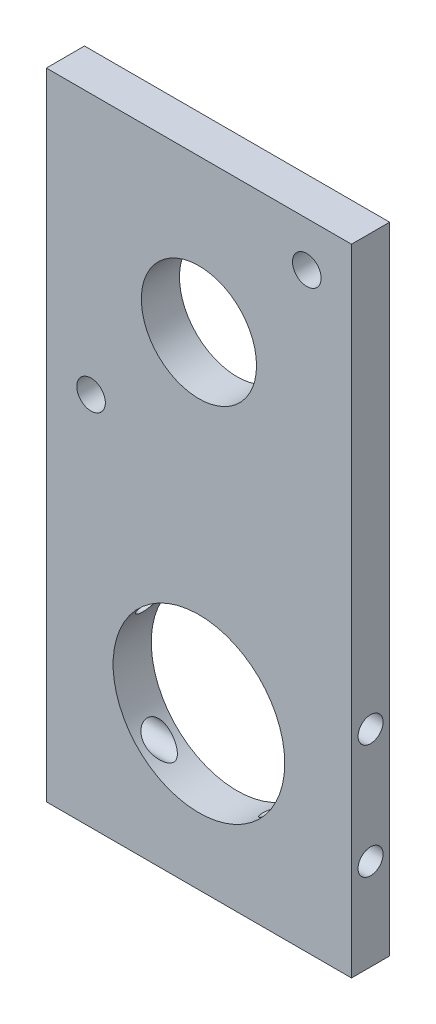
ISO-10303-21;
HEADER;
FILE_DESCRIPTION(('STEP AP214'),'2;1');
FILE_NAME('part.step','',(''),(''),'','','');
FILE_SCHEMA(('AUTOMOTIVE_DESIGN { 1 0 10303 214 1 1 1 1 }'));
ENDSEC;
DATA;
#1=APPLICATION_CONTEXT('core data for automotive mechanical design processes');
#2=APPLICATION_PROTOCOL_DEFINITION('international standard','automotive_design',2000,#1);
#3=PRODUCT_CONTEXT('',#1,'mechanical');
#4=PRODUCT('Part','Part','',(#3));
#5=PRODUCT_RELATED_PRODUCT_CATEGORY('part','',(#4));
#6=PRODUCT_DEFINITION_FORMATION('','',#4);
#7=PRODUCT_DEFINITION_CONTEXT('part definition',#1,'design');
#8=PRODUCT_DEFINITION('design','',#6,#7);
#9=PRODUCT_DEFINITION_SHAPE('','',#8);
#10=(LENGTH_UNIT() NAMED_UNIT(*) SI_UNIT(.MILLI.,.METRE.));
#11=(NAMED_UNIT(*) PLANE_ANGLE_UNIT() SI_UNIT($,.RADIAN.));
#12=(NAMED_UNIT(*) SI_UNIT($,.STERADIAN.) SOLID_ANGLE_UNIT());
#13=UNCERTAINTY_MEASURE_WITH_UNIT(LENGTH_MEASURE(1.E-05),#10,'distance_accuracy_value','');
#14=(GEOMETRIC_REPRESENTATION_CONTEXT(3) GLOBAL_UNCERTAINTY_ASSIGNED_CONTEXT((#13)) GLOBAL_UNIT_ASSIGNED_CONTEXT((#10,
#11,#12)) REPRESENTATION_CONTEXT('',''));
#15=CARTESIAN_POINT('',(0.,0.,0.));
#16=DIRECTION('',(0.,0.,1.));
#17=DIRECTION('',(1.,0.,0.));
#18=AXIS2_PLACEMENT_3D('',#15,#16,#17);
#19=CARTESIAN_POINT('',(0.,0.,6.35));
#20=DIRECTION('',(0.,0.,-1.));
#21=DIRECTION('',(-1.,0.,0.));
#22=AXIS2_PLACEMENT_3D('',#19,#20,#21);
#23=PLANE('',#22);
#24=DIRECTION('',(0.,-1.,0.));
#25=VECTOR('',#24,1.);
#26=CARTESIAN_POINT('',(-25.4,25.4,6.35));
#27=LINE('',#26,#25);
#28=CARTESIAN_POINT('',(-25.4,25.4,6.35));
#29=VERTEX_POINT('',#28);
#30=CARTESIAN_POINT('',(-25.4,-80.399998966,6.35));
#31=VERTEX_POINT('',#30);
#32=EDGE_CURVE('E93',#29,#31,#27,.T.);
#33=ORIENTED_EDGE('',*,*,#32,.T.);
#34=DIRECTION('',(1.,0.,0.));
#35=VECTOR('',#34,1.);
#36=CARTESIAN_POINT('',(25.4,-80.399998966,6.35));
#37=LINE('',#36,#35);
#38=CARTESIAN_POINT('',(25.4,-80.399998966,6.35));
#39=VERTEX_POINT('',#38);
#40=EDGE_CURVE('E88',#31,#39,#37,.T.);
#41=ORIENTED_EDGE('',*,*,#40,.T.);
#42=DIRECTION('',(0.,1.,0.));
#43=VECTOR('',#42,1.);
#44=CARTESIAN_POINT('',(25.4,25.4,6.35));
#45=LINE('',#44,#43);
#46=CARTESIAN_POINT('',(25.4,25.4,6.35));
#47=VERTEX_POINT('',#46);
#48=EDGE_CURVE('E91',#39,#47,#45,.T.);
#49=ORIENTED_EDGE('',*,*,#48,.T.);
#50=DIRECTION('',(-1.,0.,0.));
#51=VECTOR('',#50,1.);
#52=CARTESIAN_POINT('',(25.4,25.4,6.35));
#53=LINE('',#52,#51);
#54=EDGE_CURVE('E58',#47,#29,#53,.T.);
#55=ORIENTED_EDGE('',*,*,#54,.T.);
#56=EDGE_LOOP('',(#33,#41,#49,#55));
#57=FACE_BOUND('',#56,.T.);
#58=CARTESIAN_POINT('',(-17.9605122421383,-17.9605122421383,6.35));
#59=DIRECTION('',(0.,0.,1.));
#60=DIRECTION('',(1.,0.,0.));
#61=AXIS2_PLACEMENT_3D('',#58,#59,#60);
#62=CIRCLE('',#61,2.38125);
#63=CARTESIAN_POINT('',(-15.5792622421383,-17.9605122421383,6.35));
#64=VERTEX_POINT('',#63);
#65=EDGE_CURVE('E109',#64,#64,#62,.T.);
#66=ORIENTED_EDGE('',*,*,#65,.F.);
#67=EDGE_LOOP('',(#66));
#68=FACE_BOUND('',#67,.T.);
#69=CARTESIAN_POINT('',(0.,0.,6.35));
#70=DIRECTION('',(0.,0.,1.));
#71=DIRECTION('',(1.,0.,0.));
#72=AXIS2_PLACEMENT_3D('',#69,#70,#71);
#73=CIRCLE('',#72,9.5885);
#74=CARTESIAN_POINT('',(9.5885,0.,6.35));
#75=VERTEX_POINT('',#74);
#76=EDGE_CURVE('E179',#75,#75,#73,.T.);
#77=ORIENTED_EDGE('',*,*,#76,.F.);
#78=EDGE_LOOP('',(#77));
#79=FACE_BOUND('',#78,.T.);
#80=CARTESIAN_POINT('',(17.9605122421383,17.9605122421383,6.35));
#81=DIRECTION('',(0.,0.,1.));
#82=DIRECTION('',(1.,0.,0.));
#83=AXIS2_PLACEMENT_3D('',#80,#81,#82);
#84=CIRCLE('',#83,2.38125);
#85=CARTESIAN_POINT('',(20.3417622421383,17.9605122421383,6.35));
#86=VERTEX_POINT('',#85);
#87=EDGE_CURVE('E173',#86,#86,#84,.T.);
#88=ORIENTED_EDGE('',*,*,#87,.F.);
#89=EDGE_LOOP('',(#88));
#90=FACE_BOUND('',#89,.T.);
#91=CARTESIAN_POINT('',(0.,-54.999998966,6.35));
#92=DIRECTION('',(0.,0.,1.));
#93=DIRECTION('',(1.,0.,0.));
#94=AXIS2_PLACEMENT_3D('',#91,#92,#93);
#95=CIRCLE('',#94,14.2875);
#96=CARTESIAN_POINT('',(14.2875,-54.999998966,6.35));
#97=VERTEX_POINT('',#96);
#98=EDGE_CURVE('E164',#97,#97,#95,.T.);
#99=ORIENTED_EDGE('',*,*,#98,.F.);
#100=EDGE_LOOP('',(#99));
#101=FACE_BOUND('',#100,.T.);
#102=ADVANCED_FACE('F34',(#57,#68,#79,#90,#101),#23,.F.);
#103=CARTESIAN_POINT('',(0.,0.,0.));
#104=DIRECTION('',(0.,0.,-1.));
#105=DIRECTION('',(-1.,0.,0.));
#106=AXIS2_PLACEMENT_3D('',#103,#104,#105);
#107=PLANE('',#106);
#108=CARTESIAN_POINT('',(17.9605122421383,17.9605122421383,0.));
#109=DIRECTION('',(0.,0.,1.));
#110=DIRECTION('',(1.,0.,0.));
#111=AXIS2_PLACEMENT_3D('',#108,#109,#110);
#112=CIRCLE('',#111,2.38125);
#113=CARTESIAN_POINT('',(20.3417622421383,17.9605122421383,0.));
#114=VERTEX_POINT('',#113);
#115=EDGE_CURVE('E169',#114,#114,#112,.T.);
#116=ORIENTED_EDGE('',*,*,#115,.T.);
#117=EDGE_LOOP('',(#116));
#118=FACE_BOUND('',#117,.T.);
#119=CARTESIAN_POINT('',(-17.9605122421383,-17.9605122421383,0.));
#120=DIRECTION('',(0.,0.,1.));
#121=DIRECTION('',(1.,0.,0.));
#122=AXIS2_PLACEMENT_3D('',#119,#120,#121);
#123=CIRCLE('',#122,2.38125);
#124=CARTESIAN_POINT('',(-15.5792622421383,-17.9605122421383,0.));
#125=VERTEX_POINT('',#124);
#126=EDGE_CURVE('E182',#125,#125,#123,.T.);
#127=ORIENTED_EDGE('',*,*,#126,.T.);
#128=EDGE_LOOP('',(#127));
#129=FACE_BOUND('',#128,.T.);
#130=DIRECTION('',(0.,-1.,0.));
#131=VECTOR('',#130,1.);
#132=CARTESIAN_POINT('',(-25.4,25.4,0.));
#133=LINE('',#132,#131);
#134=CARTESIAN_POINT('',(-25.4,25.4,0.));
#135=VERTEX_POINT('',#134);
#136=CARTESIAN_POINT('',(-25.4,-80.399998966,0.));
#137=VERTEX_POINT('',#136);
#138=EDGE_CURVE('E106',#135,#137,#133,.T.);
#139=ORIENTED_EDGE('',*,*,#138,.F.);
#140=DIRECTION('',(-1.,0.,0.));
#141=VECTOR('',#140,1.);
#142=CARTESIAN_POINT('',(25.4,25.4,0.));
#143=LINE('',#142,#141);
#144=CARTESIAN_POINT('',(25.4,25.4,0.));
#145=VERTEX_POINT('',#144);
#146=EDGE_CURVE('E81',#145,#135,#143,.T.);
#147=ORIENTED_EDGE('',*,*,#146,.F.);
#148=DIRECTION('',(0.,1.,0.));
#149=VECTOR('',#148,1.);
#150=CARTESIAN_POINT('',(25.4,25.4,0.));
#151=LINE('',#150,#149);
#152=CARTESIAN_POINT('',(25.4,-80.399998966,0.));
#153=VERTEX_POINT('',#152);
#154=EDGE_CURVE('E75',#153,#145,#151,.T.);
#155=ORIENTED_EDGE('',*,*,#154,.F.);
#156=DIRECTION('',(1.,0.,0.));
#157=VECTOR('',#156,1.);
#158=CARTESIAN_POINT('',(25.4,-80.399998966,0.));
#159=LINE('',#158,#157);
#160=EDGE_CURVE('E97',#137,#153,#159,.T.);
#161=ORIENTED_EDGE('',*,*,#160,.F.);
#162=EDGE_LOOP('',(#139,#147,#155,#161));
#163=FACE_BOUND('',#162,.T.);
#164=CARTESIAN_POINT('',(0.,0.,0.));
#165=DIRECTION('',(0.,0.,1.));
#166=DIRECTION('',(1.,0.,0.));
#167=AXIS2_PLACEMENT_3D('',#164,#165,#166);
#168=CIRCLE('',#167,9.5885);
#169=CARTESIAN_POINT('',(9.5885,0.,0.));
#170=VERTEX_POINT('',#169);
#171=EDGE_CURVE('E176',#170,#170,#168,.T.);
#172=ORIENTED_EDGE('',*,*,#171,.T.);
#173=EDGE_LOOP('',(#172));
#174=FACE_BOUND('',#173,.T.);
#175=CARTESIAN_POINT('',(0.,-54.999998966,0.));
#176=DIRECTION('',(0.,0.,1.));
#177=DIRECTION('',(1.,0.,0.));
#178=AXIS2_PLACEMENT_3D('',#175,#176,#177);
#179=CIRCLE('',#178,14.2875);
#180=CARTESIAN_POINT('',(14.2875,-54.999998966,0.));
#181=VERTEX_POINT('',#180);
#182=EDGE_CURVE('E149',#181,#181,#179,.T.);
#183=ORIENTED_EDGE('',*,*,#182,.T.);
#184=EDGE_LOOP('',(#183));
#185=FACE_BOUND('',#184,.T.);
#186=ADVANCED_FACE('F190',(#118,#129,#163,#174,#185),#107,.T.);
#187=CARTESIAN_POINT('',(-25.4,25.4,6.35));
#188=DIRECTION('',(1.,0.,0.));
#189=DIRECTION('',(0.,1.,0.));
#190=AXIS2_PLACEMENT_3D('',#187,#188,#189);
#191=PLANE('',#190);
#192=CARTESIAN_POINT('',(-25.4,-65.159998966,3.175));
#193=DIRECTION('',(1.,0.,0.));
#194=DIRECTION('',(0.,1.,0.));
#195=AXIS2_PLACEMENT_3D('',#192,#193,#194);
#196=CIRCLE('',#195,2.0828);
#197=CARTESIAN_POINT('',(-25.4,-63.077198966,3.175));
#198=VERTEX_POINT('',#197);
#199=EDGE_CURVE('E123',#198,#198,#196,.T.);
#200=ORIENTED_EDGE('',*,*,#199,.T.);
#201=EDGE_LOOP('',(#200));
#202=FACE_BOUND('',#201,.T.);
#203=CARTESIAN_POINT('',(-25.4,-46.109998966,3.175));
#204=DIRECTION('',(1.,0.,0.));
#205=DIRECTION('',(0.,1.,0.));
#206=AXIS2_PLACEMENT_3D('',#203,#204,#205);
#207=CIRCLE('',#206,2.0828);
#208=CARTESIAN_POINT('',(-25.4,-44.027198966,3.175));
#209=VERTEX_POINT('',#208);
#210=EDGE_CURVE('E229',#209,#209,#207,.T.);
#211=ORIENTED_EDGE('',*,*,#210,.T.);
#212=EDGE_LOOP('',(#211));
#213=FACE_BOUND('',#212,.T.);
#214=ORIENTED_EDGE('',*,*,#138,.T.);
#215=DIRECTION('',(0.,0.,-1.));
#216=VECTOR('',#215,1.);
#217=CARTESIAN_POINT('',(-25.4,-80.399998966,6.35));
#218=LINE('',#217,#216);
#219=EDGE_CURVE('E11',#31,#137,#218,.T.);
#220=ORIENTED_EDGE('',*,*,#219,.F.);
#221=ORIENTED_EDGE('',*,*,#32,.F.);
#222=DIRECTION('',(0.,0.,-1.));
#223=VECTOR('',#222,1.);
#224=CARTESIAN_POINT('',(-25.4,25.4,6.35));
#225=LINE('',#224,#223);
#226=EDGE_CURVE('E102',#29,#135,#225,.T.);
#227=ORIENTED_EDGE('',*,*,#226,.T.);
#228=EDGE_LOOP('',(#214,#220,#221,#227));
#229=FACE_BOUND('',#228,.T.);
#230=ADVANCED_FACE('F36',(#202,#213,#229),#191,.F.);
#231=CARTESIAN_POINT('',(25.4,-80.399998966,6.35));
#232=DIRECTION('',(0.,1.,0.));
#233=DIRECTION('',(0.,0.,1.));
#234=AXIS2_PLACEMENT_3D('',#231,#232,#233);
#235=PLANE('',#234);
#236=ORIENTED_EDGE('',*,*,#160,.T.);
#237=DIRECTION('',(0.,0.,-1.));
#238=VECTOR('',#237,1.);
#239=CARTESIAN_POINT('',(25.4,-80.399998966,6.35));
#240=LINE('',#239,#238);
#241=EDGE_CURVE('E49',#39,#153,#240,.T.);
#242=ORIENTED_EDGE('',*,*,#241,.F.);
#243=ORIENTED_EDGE('',*,*,#40,.F.);
#244=ORIENTED_EDGE('',*,*,#219,.T.);
#245=EDGE_LOOP('',(#236,#242,#243,#244));
#246=FACE_BOUND('',#245,.T.);
#247=ADVANCED_FACE('F96',(#246),#235,.F.);
#248=CARTESIAN_POINT('',(25.4,25.4,6.35));
#249=DIRECTION('',(-1.,0.,0.));
#250=DIRECTION('',(0.,-1.,0.));
#251=AXIS2_PLACEMENT_3D('',#248,#249,#250);
#252=PLANE('',#251);
#253=CARTESIAN_POINT('',(25.4,-65.159998966,3.175));
#254=DIRECTION('',(1.,0.,0.));
#255=DIRECTION('',(0.,1.,0.));
#256=AXIS2_PLACEMENT_3D('',#253,#254,#255);
#257=CIRCLE('',#256,2.0828);
#258=CARTESIAN_POINT('',(25.4,-63.077198966,3.175));
#259=VERTEX_POINT('',#258);
#260=EDGE_CURVE('E234',#259,#259,#257,.T.);
#261=ORIENTED_EDGE('',*,*,#260,.F.);
#262=EDGE_LOOP('',(#261));
#263=FACE_BOUND('',#262,.T.);
#264=CARTESIAN_POINT('',(25.4,-46.109998966,3.175));
#265=DIRECTION('',(1.,0.,0.));
#266=DIRECTION('',(0.,1.,0.));
#267=AXIS2_PLACEMENT_3D('',#264,#265,#266);
#268=CIRCLE('',#267,2.0828);
#269=CARTESIAN_POINT('',(25.4,-44.027198966,3.175));
#270=VERTEX_POINT('',#269);
#271=EDGE_CURVE('E235',#270,#270,#268,.T.);
#272=ORIENTED_EDGE('',*,*,#271,.F.);
#273=EDGE_LOOP('',(#272));
#274=FACE_BOUND('',#273,.T.);
#275=ORIENTED_EDGE('',*,*,#154,.T.);
#276=DIRECTION('',(0.,0.,-1.));
#277=VECTOR('',#276,1.);
#278=CARTESIAN_POINT('',(25.4,25.4,6.35));
#279=LINE('',#278,#277);
#280=EDGE_CURVE('E98',#47,#145,#279,.T.);
#281=ORIENTED_EDGE('',*,*,#280,.F.);
#282=ORIENTED_EDGE('',*,*,#48,.F.);
#283=ORIENTED_EDGE('',*,*,#241,.T.);
#284=EDGE_LOOP('',(#275,#281,#282,#283));
#285=FACE_BOUND('',#284,.T.);
#286=ADVANCED_FACE('F100',(#263,#274,#285),#252,.F.);
#287=CARTESIAN_POINT('',(25.4,25.4,6.35));
#288=DIRECTION('',(0.,-1.,0.));
#289=DIRECTION('',(1.,0.,0.));
#290=AXIS2_PLACEMENT_3D('',#287,#288,#289);
#291=PLANE('',#290);
#292=ORIENTED_EDGE('',*,*,#146,.T.);
#293=ORIENTED_EDGE('',*,*,#226,.F.);
#294=ORIENTED_EDGE('',*,*,#54,.F.);
#295=ORIENTED_EDGE('',*,*,#280,.T.);
#296=EDGE_LOOP('',(#292,#293,#294,#295));
#297=FACE_BOUND('',#296,.T.);
#298=ADVANCED_FACE('F196',(#297),#291,.F.);
#299=CARTESIAN_POINT('',(-17.9605122421383,-17.9605122421383,6.35));
#300=DIRECTION('',(0.,0.,-1.));
#301=DIRECTION('',(-1.,0.,0.));
#302=AXIS2_PLACEMENT_3D('',#299,#300,#301);
#303=CYLINDRICAL_SURFACE('',#302,2.38125);
#304=ORIENTED_EDGE('',*,*,#65,.T.);
#305=EDGE_LOOP('',(#304));
#306=FACE_BOUND('',#305,.T.);
#307=ORIENTED_EDGE('',*,*,#126,.F.);
#308=EDGE_LOOP('',(#307));
#309=FACE_BOUND('',#308,.T.);
#310=ADVANCED_FACE('F193',(#306,#309),#303,.F.);
#311=CARTESIAN_POINT('',(0.,0.,6.35));
#312=DIRECTION('',(0.,0.,-1.));
#313=DIRECTION('',(-1.,0.,0.));
#314=AXIS2_PLACEMENT_3D('',#311,#312,#313);
#315=CYLINDRICAL_SURFACE('',#314,9.5885);
#316=ORIENTED_EDGE('',*,*,#76,.T.);
#317=EDGE_LOOP('',(#316));
#318=FACE_BOUND('',#317,.T.);
#319=ORIENTED_EDGE('',*,*,#171,.F.);
#320=EDGE_LOOP('',(#319));
#321=FACE_BOUND('',#320,.T.);
#322=ADVANCED_FACE('F195',(#318,#321),#315,.F.);
#323=CARTESIAN_POINT('',(17.9605122421383,17.9605122421383,6.35));
#324=DIRECTION('',(0.,0.,-1.));
#325=DIRECTION('',(-1.,0.,0.));
#326=AXIS2_PLACEMENT_3D('',#323,#324,#325);
#327=CYLINDRICAL_SURFACE('',#326,2.38125);
#328=ORIENTED_EDGE('',*,*,#87,.T.);
#329=EDGE_LOOP('',(#328));
#330=FACE_BOUND('',#329,.T.);
#331=ORIENTED_EDGE('',*,*,#115,.F.);
#332=EDGE_LOOP('',(#331));
#333=FACE_BOUND('',#332,.T.);
#334=ADVANCED_FACE('F157',(#330,#333),#327,.F.);
#335=CARTESIAN_POINT('',(0.,-54.999998966,6.35));
#336=DIRECTION('',(0.,0.,-1.));
#337=DIRECTION('',(-1.,0.,0.));
#338=AXIS2_PLACEMENT_3D('',#335,#336,#337);
#339=CYLINDRICAL_SURFACE('',#338,14.2875);
#340=CARTESIAN_POINT('',(-11.7852236470082,-63.077198966,3.175));
#341=CARTESIAN_POINT('',(-11.7852200210865,-63.0772061202286,3.27602967904974));
#342=CARTESIAN_POINT('',(-11.7801646655475,-63.0845957641341,3.37712905830519));
#343=CARTESIAN_POINT('',(-11.7601115695199,-63.1137360248958,3.5762709852243));
#344=CARTESIAN_POINT('',(-11.7451036211026,-63.1355013861888,3.67431028609033));
#345=CARTESIAN_POINT('',(-11.7057345254466,-63.192044289194,3.86419652589845));
#346=CARTESIAN_POINT('',(-11.6814033944205,-63.2267800632834,3.95606223659754));
#347=CARTESIAN_POINT('',(-11.6241739829658,-63.3074456435918,4.13179622119825));
#348=CARTESIAN_POINT('',(-11.5912758432201,-63.3533752659907,4.21566462639634));
#349=CARTESIAN_POINT('',(-11.5160108307966,-63.4568557224404,4.37794434711993));
#350=CARTESIAN_POINT('',(-11.4732540769725,-63.5148713023968,4.45587606548645));
#351=CARTESIAN_POINT('',(-11.3804677589648,-63.6384943242396,4.60053543709756));
#352=CARTESIAN_POINT('',(-11.3304343067992,-63.7041058208212,4.66725705938827));
#353=CARTESIAN_POINT('',(-11.2021640350764,-63.8689925913797,4.8145466212034));
#354=CARTESIAN_POINT('',(-11.1208244043545,-63.9709624817474,4.88941785188982));
#355=CARTESIAN_POINT('',(-10.9485558745201,-64.1804287715483,5.0171772409277));
#356=CARTESIAN_POINT('',(-10.8576094962387,-64.2879350556812,5.07002443262991));
#357=CARTESIAN_POINT('',(-10.6388035322822,-64.5385553535987,5.16880468225298));
#358=CARTESIAN_POINT('',(-10.5083134419513,-64.6822611015666,5.20736950824455));
#359=CARTESIAN_POINT('',(-10.2389398173102,-64.9667090071064,5.25382802491593));
#360=CARTESIAN_POINT('',(-10.1000449758161,-65.1074468126519,5.26167942043348));
#361=CARTESIAN_POINT('',(-9.86890837289177,-65.3321357745951,5.25250809263101));
#362=CARTESIAN_POINT('',(-9.77814307623636,-65.4180637821556,5.24351862114927));
#363=CARTESIAN_POINT('',(-9.5952471367907,-65.5867520890157,5.2154043217988));
#364=CARTESIAN_POINT('',(-9.503116611017,-65.6695126576492,5.19628035774935));
#365=CARTESIAN_POINT('',(-9.31805164399702,-65.8315143329004,5.14839030979613));
#366=CARTESIAN_POINT('',(-9.22511624710723,-65.9107502760037,5.1196105751978));
#367=CARTESIAN_POINT('',(-9.03929446608979,-66.0651873698356,5.05270377933805));
#368=CARTESIAN_POINT('',(-8.94640807557255,-66.1403896905116,5.01457944653189));
#369=CARTESIAN_POINT('',(-8.77955370053709,-66.2721366413259,4.93733976630736));
#370=CARTESIAN_POINT('',(-8.70543251299981,-66.3294575589607,4.89987089862276));
#371=CARTESIAN_POINT('',(-8.55828919926967,-66.441015503017,4.81871856859571));
#372=CARTESIAN_POINT('',(-8.48526684706638,-66.4952531701625,4.77503640408209));
#373=CARTESIAN_POINT('',(-8.3412027413082,-66.6002106861735,4.68124952742698));
#374=CARTESIAN_POINT('',(-8.27015612521532,-66.6509397339091,4.63116267327067));
#375=CARTESIAN_POINT('',(-8.13084652329286,-66.7485824912177,4.52396718047853));
#376=CARTESIAN_POINT('',(-8.06258157281335,-66.7954989177213,4.46686361626136));
#377=CARTESIAN_POINT('',(-7.92993354812479,-66.8850835756816,4.34457801539588));
#378=CARTESIAN_POINT('',(-7.86556732368505,-66.9277338235784,4.279364183057));
#379=CARTESIAN_POINT('',(-7.74324201273184,-67.0075037383609,4.13999943724699));
#380=CARTESIAN_POINT('',(-7.68528005065753,-67.0446258900277,4.065852566295));
#381=CARTESIAN_POINT('',(-7.5894107931374,-67.105208081159,3.92269788923124));
#382=CARTESIAN_POINT('',(-7.54978582872229,-67.1299237461775,3.85539374954056));
#383=CARTESIAN_POINT('',(-7.47991064988281,-67.173136724309,3.71421122336098));
#384=CARTESIAN_POINT('',(-7.44964144692973,-67.1916466392207,3.64034654994439));
#385=CARTESIAN_POINT('',(-7.40721237153338,-67.217459335049,3.50446897874408));
#386=CARTESIAN_POINT('',(-7.39250267409782,-67.2263515347495,3.44356570637848));
#387=CARTESIAN_POINT('',(-7.37205515378218,-67.2386920161568,3.3197382978064));
#388=CARTESIAN_POINT('',(-7.36630835190735,-67.2421457461354,3.25681624859801));
#389=CARTESIAN_POINT('',(-7.36441686622699,-67.2432837636755,3.13064229763926));
#390=CARTESIAN_POINT('',(-7.36829168163857,-67.2409563351094,3.06738998571347));
#391=CARTESIAN_POINT('',(-7.38523515588227,-67.2307409830152,2.94258709463044));
#392=CARTESIAN_POINT('',(-7.39831184174228,-67.2228482046773,2.88103805003315));
#393=CARTESIAN_POINT('',(-7.43679505486892,-67.1994807132282,2.74553078489217));
#394=CARTESIAN_POINT('',(-7.46451785584845,-67.1825717080963,2.67248750628224));
#395=CARTESIAN_POINT('',(-7.52938973402054,-67.1425852201885,2.53255621306915));
#396=CARTESIAN_POINT('',(-7.56655869051616,-67.1194947230092,2.46568158993725));
#397=CARTESIAN_POINT('',(-7.67102844457892,-67.0537794274481,2.30125751931205));
#398=CARTESIAN_POINT('',(-7.74331922360056,-67.0075828043981,2.20835122917415));
#399=CARTESIAN_POINT('',(-7.89752421549739,-66.9067338905831,2.03615687839956));
#400=CARTESIAN_POINT('',(-7.97946434959119,-66.8520586930051,1.95690697581905));
#401=CARTESIAN_POINT('',(-8.13635536938147,-66.7447866023788,1.82118781158849));
#402=CARTESIAN_POINT('',(-8.2105308782351,-66.6930919462581,1.76308354888739));
#403=CARTESIAN_POINT('',(-8.36155582012108,-66.5855779297464,1.65459932946993));
#404=CARTESIAN_POINT('',(-8.43840700130724,-66.5297558448834,1.6042245435843));
#405=CARTESIAN_POINT('',(-8.59378977860668,-66.4144112344979,1.51066191223894));
#406=CARTESIAN_POINT('',(-8.67232272797948,-66.3548856494383,1.46748012031238));
#407=CARTESIAN_POINT('',(-8.83028597245094,-66.2324829503101,1.38805946113392));
#408=CARTESIAN_POINT('',(-8.90971638412695,-66.1696053967943,1.35182150710297));
#409=CARTESIAN_POINT('',(-9.07314859531222,-66.037310843421,1.28445026217104));
#410=CARTESIAN_POINT('',(-9.15716827358786,-65.9677239245076,1.25369228116207));
#411=CARTESIAN_POINT('',(-9.32498636729341,-65.8254056053217,1.19988542963599));
#412=CARTESIAN_POINT('',(-9.40878475357643,-65.7526738108024,1.17683752885015));
#413=CARTESIAN_POINT('',(-9.6589420398794,-65.5302887687969,1.11967324176175));
#414=CARTESIAN_POINT('',(-9.82435279881833,-65.3762123900095,1.09741679328825));
#415=CARTESIAN_POINT('',(-10.1236984343917,-65.0836728702183,1.08926434215749));
#416=CARTESIAN_POINT('',(-10.2586232990871,-64.9463507077387,1.09839933669844));
#417=CARTESIAN_POINT('',(-10.520428161798,-64.6689893296188,1.14603362234142));
#418=CARTESIAN_POINT('',(-10.647317589607,-64.5289535604482,1.1844977763711));
#419=CARTESIAN_POINT('',(-10.8607714176662,-64.2841920197262,1.28183845452184));
#420=CARTESIAN_POINT('',(-10.9498126123361,-64.1788894142101,1.33380963256619));
#421=CARTESIAN_POINT('',(-11.1186837516055,-63.973576490209,1.45894025131486));
#422=CARTESIAN_POINT('',(-11.1985261805432,-63.8735591010517,1.53207049032041));
#423=CARTESIAN_POINT('',(-11.3325992889651,-63.701406414198,1.68462768407744));
#424=CARTESIAN_POINT('',(-11.388829853455,-63.6275490471228,1.7603398372177));
#425=CARTESIAN_POINT('',(-11.4919060499564,-63.4897661258315,1.92600731284728));
#426=CARTESIAN_POINT('',(-11.5387517569073,-63.42584049231,2.01596252159348));
#427=CARTESIAN_POINT('',(-11.6217499327717,-63.3109966698791,2.20961230442198));
#428=CARTESIAN_POINT('',(-11.6578132380186,-63.2601873915382,2.31341170194376));
#429=CARTESIAN_POINT('',(-11.7022834978821,-63.1969420960733,2.47651376763692));
#430=CARTESIAN_POINT('',(-11.7155003154065,-63.1780254452704,2.53209742731726));
#431=CARTESIAN_POINT('',(-11.7386078560327,-63.14482257132,2.64529184422147));
#432=CARTESIAN_POINT('',(-11.7485001218647,-63.1305342005699,2.70290164748254));
#433=CARTESIAN_POINT('',(-11.7661316384559,-63.1050026758823,2.82887490706305));
#434=CARTESIAN_POINT('',(-11.7732806544066,-63.094601812151,2.89749486766826));
#435=CARTESIAN_POINT('',(-11.782827659066,-63.080697853337,3.03573224682427));
#436=CARTESIAN_POINT('',(-11.7852261467393,-63.0771940338338,3.10534955984593));
#437=CARTESIAN_POINT('',(-11.7852236470082,-63.077198966,3.175));
#438=B_SPLINE_CURVE_WITH_KNOTS('',3,(#340,#341,#342,#343,#344,#345,#346,#347,#348,#349,#350,
#351,#352,#353,#354,#355,#356,#357,#358,#359,#360,#361,#362,#363,#364,#365,#366,#367,#368,#369,
#370,#371,#372,#373,#374,#375,#376,#377,#378,#379,#380,#381,#382,#383,#384,#385,#386,#387,#388,
#389,#390,#391,#392,#393,#394,#395,#396,#397,#398,#399,#400,#401,#402,#403,#404,#405,#406,#407,
#408,#409,#410,#411,#412,#413,#414,#415,#416,#417,#418,#419,#420,#421,#422,#423,#424,#425,#426,
#427,#428,#429,#430,#431,#432,#433,#434,#435,#436,#437),.UNSPECIFIED.,.T.,.F.,(4,2,2,2,2,2,2,2,
2,2,2,2,2,2,2,2,2,2,2,2,2,2,2,2,2,2,2,2,2,2,2,2,2,2,2,2,2,2,2,2,2,2,2,2,2,2,2,2,4),(0.,
0.302822882057644,0.605956837345417,0.908122935991352,1.21028407294396,1.52748926998896,
1.84486457853834,2.29358161927353,2.74312962748938,3.33368623936297,3.92505581522874,
4.30056929783118,4.6760507784735,5.0520653427947,5.42797024811205,5.73048950159227,
6.0329456576186,6.33457615958716,6.63598979506337,6.93862473036334,7.24112322336332,
7.48610255252898,7.73058135427422,7.91963337805558,8.10849588830665,8.29774146051276,
8.48715232146738,8.7256220256251,8.96459780290731,9.34186266822415,9.72016515400229,
10.0421522194956,10.3643537560449,10.6868250981572,11.0093388211229,11.3490527130979,
11.6888093163577,12.3671610074305,12.9434008756169,13.5189514764676,13.9594832002253,
14.3994098211073,14.7573316742172,15.1152506691558,15.4760523934211,15.6563466946597,
15.8365572159564,16.0453469786543,16.2541148102699),.UNSPECIFIED.);
#439=CARTESIAN_POINT('',(-11.7852236470082,-63.077198966,3.175));
#440=VERTEX_POINT('',#439);
#441=EDGE_CURVE('E38',#440,#440,#438,.T.);
#442=ORIENTED_EDGE('',*,*,#441,.F.);
#443=EDGE_LOOP('',(#442));
#444=FACE_BOUND('',#443,.T.);
#445=CARTESIAN_POINT('',(11.7852236470081,-63.077198966,3.175));
#446=CARTESIAN_POINT('',(11.7852200210865,-63.0772061202286,3.07397032095025));
#447=CARTESIAN_POINT('',(11.7801646655474,-63.0845957641341,2.97287094169481));
#448=CARTESIAN_POINT('',(11.7601115695198,-63.1137360248958,2.77372901477569));
#449=CARTESIAN_POINT('',(11.7451036211026,-63.1355013861888,2.67568971390967));
#450=CARTESIAN_POINT('',(11.7057345254466,-63.192044289194,2.48580347410154));
#451=CARTESIAN_POINT('',(11.6814033944204,-63.2267800632834,2.39393776340246));
#452=CARTESIAN_POINT('',(11.6241739829658,-63.3074456435918,2.21820377880175));
#453=CARTESIAN_POINT('',(11.59127584322,-63.3533752659907,2.13433537360365));
#454=CARTESIAN_POINT('',(11.5160108307966,-63.4568557224404,1.97205565288006));
#455=CARTESIAN_POINT('',(11.4732540769725,-63.5148713023968,1.89412393451354));
#456=CARTESIAN_POINT('',(11.3804677589648,-63.6384943242396,1.74946456290244));
#457=CARTESIAN_POINT('',(11.3304343067992,-63.7041058208212,1.68274294061172));
#458=CARTESIAN_POINT('',(11.2021640350763,-63.8689925913797,1.5354533787966));
#459=CARTESIAN_POINT('',(11.1208244043545,-63.9709624817474,1.46058214811018));
#460=CARTESIAN_POINT('',(10.9485558745201,-64.1804287715483,1.3328227590723));
#461=CARTESIAN_POINT('',(10.8576094962387,-64.2879350556812,1.27997556737009));
#462=CARTESIAN_POINT('',(10.6388035322822,-64.5385553535987,1.18119531774702));
#463=CARTESIAN_POINT('',(10.5083134419512,-64.6822611015666,1.14263049175545));
#464=CARTESIAN_POINT('',(10.2389398173101,-64.9667090071064,1.09617197508407));
#465=CARTESIAN_POINT('',(10.1000449758161,-65.1074468126519,1.08832057956652));
#466=CARTESIAN_POINT('',(9.86890837289173,-65.3321357745951,1.09749190736899));
#467=CARTESIAN_POINT('',(9.77814307623633,-65.4180637821556,1.10648137885073));
#468=CARTESIAN_POINT('',(9.59524713679067,-65.5867520890157,1.13459567820121));
#469=CARTESIAN_POINT('',(9.50311661101697,-65.6695126576492,1.15371964225065));
#470=CARTESIAN_POINT('',(9.31805164399699,-65.8315143329004,1.20160969020387));
#471=CARTESIAN_POINT('',(9.2251162471072,-65.9107502760037,1.2303894248022));
#472=CARTESIAN_POINT('',(9.03929446608976,-66.0651873698356,1.29729622066195));
#473=CARTESIAN_POINT('',(8.94640807557252,-66.1403896905116,1.33542055346812));
#474=CARTESIAN_POINT('',(8.77955370053706,-66.2721366413259,1.41266023369264));
#475=CARTESIAN_POINT('',(8.70543251299978,-66.3294575589607,1.45012910137724));
#476=CARTESIAN_POINT('',(8.55828919926964,-66.441015503017,1.53128143140429));
#477=CARTESIAN_POINT('',(8.48526684706634,-66.4952531701625,1.57496359591792));
#478=CARTESIAN_POINT('',(8.34120274130816,-66.6002106861735,1.66875047257303));
#479=CARTESIAN_POINT('',(8.27015612521529,-66.6509397339091,1.71883732672933));
#480=CARTESIAN_POINT('',(8.13084652329283,-66.7485824912177,1.82603281952147));
#481=CARTESIAN_POINT('',(8.06258157281332,-66.7954989177213,1.88313638373864));
#482=CARTESIAN_POINT('',(7.92993354812476,-66.8850835756816,2.00542198460412));
#483=CARTESIAN_POINT('',(7.86556732368502,-66.9277338235784,2.070635816943));
#484=CARTESIAN_POINT('',(7.74324201273181,-67.0075037383609,2.21000056275301));
#485=CARTESIAN_POINT('',(7.6852800506575,-67.0446258900277,2.28414743370501));
#486=CARTESIAN_POINT('',(7.58941079313737,-67.105208081159,2.42730211076876));
#487=CARTESIAN_POINT('',(7.54978582872226,-67.1299237461775,2.49460625045944));
#488=CARTESIAN_POINT('',(7.47991064988278,-67.173136724309,2.63578877663902));
#489=CARTESIAN_POINT('',(7.4496414469297,-67.1916466392207,2.70965345005562));
#490=CARTESIAN_POINT('',(7.40721237153335,-67.217459335049,2.84553102125593));
#491=CARTESIAN_POINT('',(7.39250267409779,-67.2263515347495,2.90643429362153));
#492=CARTESIAN_POINT('',(7.37205515378215,-67.2386920161568,3.03026170219361));
#493=CARTESIAN_POINT('',(7.36630835190732,-67.2421457461354,3.093183751402));
#494=CARTESIAN_POINT('',(7.36441686622697,-67.2432837636755,3.21935770236075));
#495=CARTESIAN_POINT('',(7.36829168163855,-67.2409563351094,3.28261001428653));
#496=CARTESIAN_POINT('',(7.38523515588225,-67.2307409830152,3.40741290536957));
#497=CARTESIAN_POINT('',(7.39831184174226,-67.2228482046773,3.46896194996686));
#498=CARTESIAN_POINT('',(7.4367950548689,-67.1994807132282,3.60446921510784));
#499=CARTESIAN_POINT('',(7.46451785584843,-67.1825717080963,3.67751249371777));
#500=CARTESIAN_POINT('',(7.52938973402052,-67.1425852201885,3.81744378693086));
#501=CARTESIAN_POINT('',(7.56655869051614,-67.1194947230092,3.88431841006275));
#502=CARTESIAN_POINT('',(7.6710284445789,-67.0537794274481,4.04874248068796));
#503=CARTESIAN_POINT('',(7.74331922360054,-67.007582804398,4.14164877082586));
#504=CARTESIAN_POINT('',(7.89752421549738,-66.9067338905831,4.31384312160045));
#505=CARTESIAN_POINT('',(7.97946434959118,-66.8520586930051,4.39309302418096));
#506=CARTESIAN_POINT('',(8.13635536938146,-66.7447866023788,4.52881218841152));
#507=CARTESIAN_POINT('',(8.21053087823508,-66.6930919462581,4.58691645111262));
#508=CARTESIAN_POINT('',(8.36155582012107,-66.5855779297464,4.69540067053008));
#509=CARTESIAN_POINT('',(8.43840700130723,-66.5297558448834,4.74577545641571));
#510=CARTESIAN_POINT('',(8.59378977860667,-66.4144112344979,4.83933808776108));
#511=CARTESIAN_POINT('',(8.67232272797947,-66.3548856494383,4.88251987968763));
#512=CARTESIAN_POINT('',(8.83028597245093,-66.23248295031,4.9619405388661));
#513=CARTESIAN_POINT('',(8.90971638412695,-66.1696053967943,4.99817849289704));
#514=CARTESIAN_POINT('',(9.07314859531222,-66.037310843421,5.06554973782897));
#515=CARTESIAN_POINT('',(9.15716827358786,-65.9677239245075,5.09630771883794));
#516=CARTESIAN_POINT('',(9.32498636729341,-65.8254056053217,5.15011457036402));
#517=CARTESIAN_POINT('',(9.40878475357643,-65.7526738108024,5.17316247114986));
#518=CARTESIAN_POINT('',(9.65894203987941,-65.5302887687969,5.23032675823826));
#519=CARTESIAN_POINT('',(9.82435279881834,-65.3762123900095,5.25258320671175));
#520=CARTESIAN_POINT('',(10.1236984343917,-65.0836728702183,5.2607356578425));
#521=CARTESIAN_POINT('',(10.2586232990871,-64.9463507077386,5.25160066330156));
#522=CARTESIAN_POINT('',(10.520428161798,-64.6689893296187,5.20396637765858));
#523=CARTESIAN_POINT('',(10.647317589607,-64.5289535604481,5.16550222362889));
#524=CARTESIAN_POINT('',(10.8607714176662,-64.2841920197262,5.06816154547816));
#525=CARTESIAN_POINT('',(10.9498126123361,-64.17888941421,5.0161903674338));
#526=CARTESIAN_POINT('',(11.1186837516055,-63.9735764902089,4.89105974868513));
#527=CARTESIAN_POINT('',(11.1985261805432,-63.8735591010516,4.81792950967958));
#528=CARTESIAN_POINT('',(11.332599288965,-63.7014064141979,4.66537231592255));
#529=CARTESIAN_POINT('',(11.3888298534549,-63.6275490471228,4.58966016278229));
#530=CARTESIAN_POINT('',(11.4919060499563,-63.4897661258315,4.42399268715271));
#531=CARTESIAN_POINT('',(11.5387517569073,-63.42584049231,4.33403747840651));
#532=CARTESIAN_POINT('',(11.6217499327717,-63.3109966698791,4.14038769557801));
#533=CARTESIAN_POINT('',(11.6578132380185,-63.2601873915382,4.03658829805622));
#534=CARTESIAN_POINT('',(11.702283497882,-63.1969420960733,3.87348623236306));
#535=CARTESIAN_POINT('',(11.7155003154064,-63.1780254452704,3.81790257268273));
#536=CARTESIAN_POINT('',(11.7386078560327,-63.14482257132,3.70470815577852));
#537=CARTESIAN_POINT('',(11.7485001218646,-63.1305342005699,3.64709835251744));
#538=CARTESIAN_POINT('',(11.7661316384559,-63.1050026758823,3.52112509293694));
#539=CARTESIAN_POINT('',(11.7732806544066,-63.094601812151,3.45250513233173));
#540=CARTESIAN_POINT('',(11.782827659066,-63.080697853337,3.31426775317572));
#541=CARTESIAN_POINT('',(11.7852261467393,-63.0771940338338,3.24465044015407));
#542=CARTESIAN_POINT('',(11.7852236470081,-63.077198966,3.175));
#543=B_SPLINE_CURVE_WITH_KNOTS('',3,(#445,#446,#447,#448,#449,#450,#451,#452,#453,#454,#455,
#456,#457,#458,#459,#460,#461,#462,#463,#464,#465,#466,#467,#468,#469,#470,#471,#472,#473,#474,
#475,#476,#477,#478,#479,#480,#481,#482,#483,#484,#485,#486,#487,#488,#489,#490,#491,#492,#493,
#494,#495,#496,#497,#498,#499,#500,#501,#502,#503,#504,#505,#506,#507,#508,#509,#510,#511,#512,
#513,#514,#515,#516,#517,#518,#519,#520,#521,#522,#523,#524,#525,#526,#527,#528,#529,#530,#531,
#532,#533,#534,#535,#536,#537,#538,#539,#540,#541,#542),.UNSPECIFIED.,.T.,.F.,(4,2,2,2,2,2,2,2,
2,2,2,2,2,2,2,2,2,2,2,2,2,2,2,2,2,2,2,2,2,2,2,2,2,2,2,2,2,2,2,2,2,2,2,2,2,2,2,2,4),(0.,
0.302822882057645,0.605956837345421,0.908122935991359,1.21028407294397,1.52748926998897,
1.84486457853835,2.29358161927354,2.74312962748938,3.33368623936298,3.92505581522875,
4.30056929783118,4.67605077847351,5.05206534279471,5.42797024811205,5.73048950159229,
6.03294565761861,6.33457615958716,6.63598979506337,6.93862473036334,7.24112322336333,
7.48610255252898,7.73058135427422,7.91963337805558,8.10849588830665,8.29774146051277,
8.48715232146739,8.72562202562511,8.96459780290731,9.34186266822416,9.72016515400231,
10.0421522194956,10.3643537560449,10.6868250981572,11.0093388211229,11.3490527130979,
11.6888093163577,12.3671610074305,12.943400875617,13.5189514764676,13.9594832002253,
14.3994098211073,14.7573316742172,15.1152506691558,15.4760523934211,15.6563466946597,
15.8365572159564,16.0453469786543,16.2541148102699),.UNSPECIFIED.);
#544=CARTESIAN_POINT('',(11.7852236470081,-63.077198966,3.175));
#545=VERTEX_POINT('',#544);
#546=EDGE_CURVE('E142',#545,#545,#543,.T.);
#547=ORIENTED_EDGE('',*,*,#546,.F.);
#548=EDGE_LOOP('',(#547));
#549=FACE_BOUND('',#548,.T.);
#550=CARTESIAN_POINT('',(-9.15042711626077,-44.027198966,3.175));
#551=CARTESIAN_POINT('',(-9.15043989269989,-44.0272081901678,3.26454890008489));
#552=CARTESIAN_POINT('',(-9.15745124702471,-44.0330448509167,3.35424979131611));
#553=CARTESIAN_POINT('',(-9.18461930286792,-44.0557898806743,3.53027266863463));
#554=CARTESIAN_POINT('',(-9.20481297815591,-44.0727293914967,3.61658442483242));
#555=CARTESIAN_POINT('',(-9.25582104119894,-44.1159041378814,3.78237938513075));
#556=CARTESIAN_POINT('',(-9.28652083306931,-44.1420391561943,3.86192515954951));
#557=CARTESIAN_POINT('',(-9.35612647122974,-44.2019589936266,4.01413154413941));
#558=CARTESIAN_POINT('',(-9.39503406139305,-44.235745438522,4.08679068637723));
#559=CARTESIAN_POINT('',(-9.50214858669181,-44.3299803177561,4.26331141002632));
#560=CARTESIAN_POINT('',(-9.57465639179471,-44.3948380007538,4.36219603748722));
#561=CARTESIAN_POINT('',(-9.72859437954164,-44.5358662802053,4.54373252998836));
#562=CARTESIAN_POINT('',(-9.81004853740148,-44.6120674799977,4.62633903266863));
#563=CARTESIAN_POINT('',(-9.95179425490305,-44.7481268322216,4.75267772733697));
#564=CARTESIAN_POINT('',(-10.0107505294306,-44.8056568797475,4.80049363260949));
#565=CARTESIAN_POINT('',(-10.1302652549465,-44.9244099180688,4.88903721909895));
#566=CARTESIAN_POINT('',(-10.1908242656099,-44.9856342087053,4.92976238558257));
#567=CARTESIAN_POINT('',(-10.3738759184891,-45.1742209108612,5.04147877037248));
#568=CARTESIAN_POINT('',(-10.4977890625935,-45.3065408035246,5.10205056017366));
#569=CARTESIAN_POINT('',(-10.7466375876662,-45.5831203951263,5.1954083071399));
#570=CARTESIAN_POINT('',(-10.8715637954867,-45.7275185552292,5.22780321739683));
#571=CARTESIAN_POINT('',(-11.1171266289937,-46.0234213532495,5.26130393859568));
#572=CARTESIAN_POINT('',(-11.2377677855258,-46.1749180668479,5.26244384434584));
#573=CARTESIAN_POINT('',(-11.4492033172386,-46.4517317785038,5.23335956806839));
#574=CARTESIAN_POINT('',(-11.5413516940729,-46.5766294687726,5.20897804458177));
#575=CARTESIAN_POINT('',(-11.7182224659092,-46.8244879243104,5.13566590599119));
#576=CARTESIAN_POINT('',(-11.8029536624519,-46.9474508392748,5.08676486365671));
#577=CARTESIAN_POINT('',(-11.9493878488227,-47.1667849583596,4.97329992613966));
#578=CARTESIAN_POINT('',(-12.0125812593317,-47.2641892775325,4.91266725682844));
#579=CARTESIAN_POINT('',(-12.1306740227791,-47.4507228061496,4.77314250179381));
#580=CARTESIAN_POINT('',(-12.1855751924996,-47.5398538265715,4.69425442534342));
#581=CARTESIAN_POINT('',(-12.2859217666944,-47.70628148007,4.51838710804168));
#582=CARTESIAN_POINT('',(-12.3312994189953,-47.7834923485105,4.42128697124824));
#583=CARTESIAN_POINT('',(-12.4106789061678,-47.9208722116568,4.21156488800134));
#584=CARTESIAN_POINT('',(-12.4446887947846,-47.9810532668563,4.09895401068987));
#585=CARTESIAN_POINT('',(-12.4967198501813,-48.0741676251823,3.87694392773889));
#586=CARTESIAN_POINT('',(-12.5162148490674,-48.1095773980814,3.76892513059467));
#587=CARTESIAN_POINT('',(-12.5451582732518,-48.1624125840402,3.54729627981186));
#588=CARTESIAN_POINT('',(-12.5546126996327,-48.179848739448,3.43368960848855));
#589=CARTESIAN_POINT('',(-12.5628712083591,-48.1950756297197,3.21447240902914));
#590=CARTESIAN_POINT('',(-12.5625067088148,-48.1944000059873,3.10899611497117));
#591=CARTESIAN_POINT('',(-12.5531714604925,-48.1771961437421,2.89974796721376));
#592=CARTESIAN_POINT('',(-12.5442024775602,-48.1606711578976,2.79597576823764));
#593=CARTESIAN_POINT('',(-12.5180870293524,-48.1129918544498,2.59484451905058));
#594=CARTESIAN_POINT('',(-12.5010822903151,-48.0820912207465,2.49740639570374));
#595=CARTESIAN_POINT('',(-12.4593216807982,-48.0071605550859,2.30951290228627));
#596=CARTESIAN_POINT('',(-12.4345650428125,-47.9631292230944,2.21905822474415));
#597=CARTESIAN_POINT('',(-12.3766628444315,-47.8617637733233,2.04360587539429));
#598=CARTESIAN_POINT('',(-12.3432180135715,-47.8039629226617,1.95897783335102));
#599=CARTESIAN_POINT('',(-12.2692099413082,-47.6784933726359,1.80092780638425));
#600=CARTESIAN_POINT('',(-12.2286445589191,-47.6108217063823,1.72750920433081));
#601=CARTESIAN_POINT('',(-12.1370671870408,-47.4612569227119,1.58638400249413));
#602=CARTESIAN_POINT('',(-12.0854307132483,-47.3786244417744,1.51986959426158));
#603=CARTESIAN_POINT('',(-11.975694361465,-47.2073251850166,1.40164736589088));
#604=CARTESIAN_POINT('',(-11.9175914207765,-47.1186555576213,1.3499466036986));
#605=CARTESIAN_POINT('',(-11.7871757009607,-46.924686021971,1.25467569891974));
#606=CARTESIAN_POINT('',(-11.7140242835759,-46.8188396000938,1.21337302668));
#607=CARTESIAN_POINT('',(-11.5621996776201,-46.6056335089554,1.14896312963086));
#608=CARTESIAN_POINT('',(-11.4835235712,-46.498273064354,1.12586559974034));
#609=CARTESIAN_POINT('',(-11.3073429577604,-46.2649152212879,1.09405539869427));
#610=CARTESIAN_POINT('',(-11.2090161499656,-46.1390787705054,1.08872213445497));
#611=CARTESIAN_POINT('',(-11.0086680046676,-45.8913577886132,1.09999322177288));
#612=CARTESIAN_POINT('',(-10.9066434109094,-45.7694769290178,1.11661738903967));
#613=CARTESIAN_POINT('',(-10.6826959810504,-45.5106970191984,1.17512873379963));
#614=CARTESIAN_POINT('',(-10.5604505888527,-45.3749635364489,1.22097034956602));
#615=CARTESIAN_POINT('',(-10.3171563991029,-45.1146230354615,1.3398476942874));
#616=CARTESIAN_POINT('',(-10.196107946354,-44.9900191448036,1.41289103770708));
#617=CARTESIAN_POINT('',(-9.9835563432086,-44.7784972299251,1.56912605056822));
#618=CARTESIAN_POINT('',(-9.89097404913925,-44.6890184648974,1.64739146730705));
#619=CARTESIAN_POINT('',(-9.71329211700615,-44.5214779460762,1.82248283431161));
#620=CARTESIAN_POINT('',(-9.62817846834596,-44.443394624482,1.91927289902072));
#621=CARTESIAN_POINT('',(-9.49601419280057,-44.324624010673,2.09883788553521));
#622=CARTESIAN_POINT('',(-9.44544235972811,-44.279922439986,2.17635377461573));
#623=CARTESIAN_POINT('',(-9.35321452541544,-44.1993616469872,2.34081143399461));
#624=CARTESIAN_POINT('',(-9.31154734492942,-44.16349132887,2.42774117660712));
#625=CARTESIAN_POINT('',(-9.24792417025251,-44.1091798782052,2.59138508028571));
#626=CARTESIAN_POINT('',(-9.22367571424132,-44.0886703742139,2.66651323080995));
#627=CARTESIAN_POINT('',(-9.18490533907285,-44.0560131347757,2.82091160582129));
#628=CARTESIAN_POINT('',(-9.17035791090156,-44.0438434672383,2.90017037163947));
#629=CARTESIAN_POINT('',(-9.15772155354626,-44.0332852768522,3.01260987182587));
#630=CARTESIAN_POINT('',(-9.15499315027551,-44.0310079544167,3.04497681947454));
#631=CARTESIAN_POINT('',(-9.15134338367437,-44.0279629339451,3.10988911623971));
#632=CARTESIAN_POINT('',(-9.15042246996106,-44.0271956115248,3.14243450772607));
#633=CARTESIAN_POINT('',(-9.15042711626077,-44.027198966,3.175));
#634=B_SPLINE_CURVE_WITH_KNOTS('',3,(#550,#551,#552,#553,#554,#555,#556,#557,#558,#559,#560,
#561,#562,#563,#564,#565,#566,#567,#568,#569,#570,#571,#572,#573,#574,#575,#576,#577,#578,#579,
#580,#581,#582,#583,#584,#585,#586,#587,#588,#589,#590,#591,#592,#593,#594,#595,#596,#597,#598,
#599,#600,#601,#602,#603,#604,#605,#606,#607,#608,#609,#610,#611,#612,#613,#614,#615,#616,#617,
#618,#619,#620,#621,#622,#623,#624,#625,#626,#627,#628,#629,#630,#631,#632,#633),.UNSPECIFIED.,
.T.,.F.,(4,2,2,2,2,2,2,2,2,2,2,2,2,2,2,2,2,2,2,2,2,2,2,2,2,2,2,2,2,2,2,2,2,2,2,2,2,2,2,2,2,4),
(0.,0.268481369275032,0.537719029366435,0.804108926578772,1.07055547953746,1.48441244510998,
1.89940688700663,2.18479806964919,2.47029026113167,3.04105314863473,3.61961634073664,
4.19754837673701,4.66708141203432,5.13604950507763,5.52740909274238,5.91868281101094,
6.31265223956925,6.70634195715557,7.05046951615874,7.3943912799072,7.70929074318096,
8.02412559537508,8.33360391247729,8.64311288034978,8.96516307982338,9.28731027875938,
9.63984708395808,9.99255157669795,10.3964214319874,10.8005062180304,11.2780684733207,
11.7560620041821,12.3187517706004,12.8815991669293,13.3322370502498,13.7820106450783,
14.0894390176617,14.3964791354678,14.6402513638627,14.8833800346224,14.9809921087771,
15.0786284610778),.UNSPECIFIED.);
#635=CARTESIAN_POINT('',(-9.15042711626077,-44.027198966,3.175));
#636=VERTEX_POINT('',#635);
#637=EDGE_CURVE('E122',#636,#636,#634,.T.);
#638=ORIENTED_EDGE('',*,*,#637,.F.);
#639=EDGE_LOOP('',(#638));
#640=FACE_BOUND('',#639,.T.);
#641=CARTESIAN_POINT('',(9.15042711626074,-44.027198966,3.175));
#642=CARTESIAN_POINT('',(9.15043989269985,-44.0272081901678,3.08545109991511));
#643=CARTESIAN_POINT('',(9.15745124702468,-44.0330448509167,2.99575020868389));
#644=CARTESIAN_POINT('',(9.18461930286789,-44.0557898806743,2.81972733136537));
#645=CARTESIAN_POINT('',(9.20481297815587,-44.0727293914967,2.73341557516758));
#646=CARTESIAN_POINT('',(9.2558210411989,-44.1159041378814,2.56762061486926));
#647=CARTESIAN_POINT('',(9.28652083306928,-44.1420391561943,2.48807484045049));
#648=CARTESIAN_POINT('',(9.3561264712297,-44.2019589936266,2.33586845586058));
#649=CARTESIAN_POINT('',(9.39503406139302,-44.235745438522,2.26320931362277));
#650=CARTESIAN_POINT('',(9.50214858669177,-44.3299803177561,2.08668858997367));
#651=CARTESIAN_POINT('',(9.57465639179468,-44.3948380007537,1.98780396251278));
#652=CARTESIAN_POINT('',(9.72859437954161,-44.5358662802053,1.80626747001163));
#653=CARTESIAN_POINT('',(9.81004853740145,-44.6120674799977,1.72366096733137));
#654=CARTESIAN_POINT('',(9.95179425490301,-44.7481268322216,1.59732227266303));
#655=CARTESIAN_POINT('',(10.0107505294306,-44.8056568797475,1.54950636739051));
#656=CARTESIAN_POINT('',(10.1302652549465,-44.9244099180688,1.46096278090105));
#657=CARTESIAN_POINT('',(10.1908242656098,-44.9856342087053,1.42023761441743));
#658=CARTESIAN_POINT('',(10.3738759184891,-45.1742209108612,1.30852122962752));
#659=CARTESIAN_POINT('',(10.4977890625935,-45.3065408035246,1.24794943982634));
#660=CARTESIAN_POINT('',(10.7466375876662,-45.5831203951263,1.1545916928601));
#661=CARTESIAN_POINT('',(10.8715637954867,-45.7275185552293,1.12219678260317));
#662=CARTESIAN_POINT('',(11.1171266289937,-46.0234213532496,1.08869606140432));
#663=CARTESIAN_POINT('',(11.2377677855258,-46.1749180668479,1.08755615565416));
#664=CARTESIAN_POINT('',(11.4492033172385,-46.4517317785038,1.11664043193161));
#665=CARTESIAN_POINT('',(11.5413516940729,-46.5766294687726,1.14102195541823));
#666=CARTESIAN_POINT('',(11.7182224659092,-46.8244879243104,1.21433409400881));
#667=CARTESIAN_POINT('',(11.8029536624519,-46.9474508392748,1.26323513634329));
#668=CARTESIAN_POINT('',(11.9493878488227,-47.1667849583596,1.37670007386034));
#669=CARTESIAN_POINT('',(12.0125812593317,-47.2641892775325,1.43733274317157));
#670=CARTESIAN_POINT('',(12.130674022779,-47.4507228061496,1.5768574982062));
#671=CARTESIAN_POINT('',(12.1855751924995,-47.5398538265716,1.65574557465659));
#672=CARTESIAN_POINT('',(12.2859217666944,-47.70628148007,1.83161289195833));
#673=CARTESIAN_POINT('',(12.3312994189953,-47.7834923485105,1.92871302875177));
#674=CARTESIAN_POINT('',(12.4106789061678,-47.9208722116568,2.13843511199867));
#675=CARTESIAN_POINT('',(12.4446887947846,-47.9810532668563,2.25104598931014));
#676=CARTESIAN_POINT('',(12.4967198501813,-48.0741676251823,2.47305607226112));
#677=CARTESIAN_POINT('',(12.5162148490674,-48.1095773980814,2.58107486940534));
#678=CARTESIAN_POINT('',(12.5451582732517,-48.1624125840402,2.80270372018815));
#679=CARTESIAN_POINT('',(12.5546126996327,-48.179848739448,2.91631039151146));
#680=CARTESIAN_POINT('',(12.5628712083591,-48.1950756297197,3.13552759097086));
#681=CARTESIAN_POINT('',(12.5625067088148,-48.1944000059873,3.24100388502884));
#682=CARTESIAN_POINT('',(12.5531714604925,-48.1771961437421,3.45025203278625));
#683=CARTESIAN_POINT('',(12.5442024775602,-48.1606711578976,3.55402423176237));
#684=CARTESIAN_POINT('',(12.5180870293524,-48.1129918544498,3.75515548094943));
#685=CARTESIAN_POINT('',(12.501082290315,-48.0820912207465,3.85259360429627));
#686=CARTESIAN_POINT('',(12.4593216807981,-48.0071605550859,4.04048709771374));
#687=CARTESIAN_POINT('',(12.4345650428124,-47.9631292230944,4.13094177525586));
#688=CARTESIAN_POINT('',(12.3766628444314,-47.8617637733233,4.30639412460572));
#689=CARTESIAN_POINT('',(12.3432180135714,-47.8039629226617,4.39102216664898));
#690=CARTESIAN_POINT('',(12.2692099413081,-47.6784933726359,4.54907219361576));
#691=CARTESIAN_POINT('',(12.228644558919,-47.6108217063823,4.6224907956692));
#692=CARTESIAN_POINT('',(12.1370671870408,-47.4612569227119,4.76361599750588));
#693=CARTESIAN_POINT('',(12.0854307132482,-47.3786244417744,4.83013040573843));
#694=CARTESIAN_POINT('',(11.975694361465,-47.2073251850166,4.94835263410912));
#695=CARTESIAN_POINT('',(11.9175914207764,-47.1186555576213,5.0000533963014));
#696=CARTESIAN_POINT('',(11.7871757009606,-46.924686021971,5.09532430108026));
#697=CARTESIAN_POINT('',(11.7140242835759,-46.8188396000938,5.13662697332));
#698=CARTESIAN_POINT('',(11.5621996776201,-46.6056335089553,5.20103687036914));
#699=CARTESIAN_POINT('',(11.4835235712,-46.498273064354,5.22413440025966));
#700=CARTESIAN_POINT('',(11.3073429577604,-46.2649152212879,5.25594460130573));
#701=CARTESIAN_POINT('',(11.2090161499655,-46.1390787705054,5.26127786554503));
#702=CARTESIAN_POINT('',(11.0086680046676,-45.8913577886132,5.25000677822712));
#703=CARTESIAN_POINT('',(10.9066434109093,-45.7694769290178,5.23338261096033));
#704=CARTESIAN_POINT('',(10.6826959810504,-45.5106970191984,5.17487126620037));
#705=CARTESIAN_POINT('',(10.5604505888527,-45.3749635364489,5.12902965043398));
#706=CARTESIAN_POINT('',(10.3171563991029,-45.1146230354615,5.0101523057126));
#707=CARTESIAN_POINT('',(10.1961079463539,-44.9900191448036,4.93710896229291));
#708=CARTESIAN_POINT('',(9.98355634320856,-44.778497229925,4.78087394943177));
#709=CARTESIAN_POINT('',(9.89097404913921,-44.6890184648974,4.70260853269294));
#710=CARTESIAN_POINT('',(9.71329211700611,-44.5214779460762,4.52751716568838));
#711=CARTESIAN_POINT('',(9.62817846834592,-44.443394624482,4.43072710097927));
#712=CARTESIAN_POINT('',(9.49601419280053,-44.324624010673,4.25116211446478));
#713=CARTESIAN_POINT('',(9.44544235972807,-44.279922439986,4.17364622538426));
#714=CARTESIAN_POINT('',(9.35321452541541,-44.1993616469872,4.00918856600539));
#715=CARTESIAN_POINT('',(9.31154734492939,-44.16349132887,3.92225882339288));
#716=CARTESIAN_POINT('',(9.24792417025247,-44.1091798782052,3.75861491971429));
#717=CARTESIAN_POINT('',(9.22367571424129,-44.0886703742139,3.68348676919005));
#718=CARTESIAN_POINT('',(9.18490533907281,-44.0560131347757,3.52908839417871));
#719=CARTESIAN_POINT('',(9.17035791090153,-44.0438434672383,3.44982962836053));
#720=CARTESIAN_POINT('',(9.15772155354623,-44.0332852768522,3.33739012817413));
#721=CARTESIAN_POINT('',(9.15499315027548,-44.0310079544167,3.30502318052546));
#722=CARTESIAN_POINT('',(9.15134338367434,-44.0279629339451,3.2401108837603));
#723=CARTESIAN_POINT('',(9.15042246996102,-44.0271956115248,3.20756549227393));
#724=CARTESIAN_POINT('',(9.15042711626074,-44.027198966,3.175));
#725=B_SPLINE_CURVE_WITH_KNOTS('',3,(#641,#642,#643,#644,#645,#646,#647,#648,#649,#650,#651,
#652,#653,#654,#655,#656,#657,#658,#659,#660,#661,#662,#663,#664,#665,#666,#667,#668,#669,#670,
#671,#672,#673,#674,#675,#676,#677,#678,#679,#680,#681,#682,#683,#684,#685,#686,#687,#688,#689,
#690,#691,#692,#693,#694,#695,#696,#697,#698,#699,#700,#701,#702,#703,#704,#705,#706,#707,#708,
#709,#710,#711,#712,#713,#714,#715,#716,#717,#718,#719,#720,#721,#722,#723,#724),.UNSPECIFIED.,
.T.,.F.,(4,2,2,2,2,2,2,2,2,2,2,2,2,2,2,2,2,2,2,2,2,2,2,2,2,2,2,2,2,2,2,2,2,2,2,2,2,2,2,2,2,4),
(0.,0.268481369275032,0.537719029366435,0.804108926578774,1.07055547953746,1.48441244510998,
1.89940688700663,2.18479806964919,2.47029026113168,3.04105314863474,3.61961634073665,
4.19754837673703,4.66708141203434,5.13604950507764,5.52740909274239,5.91868281101095,
6.31265223956926,6.70634195715558,7.05046951615875,7.39439127990721,7.70929074318096,
8.02412559537509,8.3336039124773,8.64311288034979,8.9651630798234,9.2873102787594,
9.63984708395809,9.99255157669796,10.3964214319874,10.8005062180304,11.2780684733207,
11.7560620041821,12.3187517706005,12.8815991669294,13.3322370502498,13.7820106450783,
14.0894390176618,14.3964791354678,14.6402513638627,14.8833800346224,14.9809921087772,
15.0786284610778),.UNSPECIFIED.);
#726=CARTESIAN_POINT('',(9.15042711626074,-44.027198966,3.175));
#727=VERTEX_POINT('',#726);
#728=EDGE_CURVE('E115',#727,#727,#725,.T.);
#729=ORIENTED_EDGE('',*,*,#728,.F.);
#730=EDGE_LOOP('',(#729));
#731=FACE_BOUND('',#730,.T.);
#732=ORIENTED_EDGE('',*,*,#98,.T.);
#733=EDGE_LOOP('',(#732));
#734=FACE_BOUND('',#733,.T.);
#735=ORIENTED_EDGE('',*,*,#182,.F.);
#736=EDGE_LOOP('',(#735));
#737=FACE_BOUND('',#736,.T.);
#738=ADVANCED_FACE('F127',(#444,#549,#640,#731,#734,#737),#339,.F.);
#739=CARTESIAN_POINT('',(-25.4,-46.109998966,3.175));
#740=DIRECTION('',(1.,0.,0.));
#741=DIRECTION('',(0.,1.,0.));
#742=AXIS2_PLACEMENT_3D('',#739,#740,#741);
#743=CYLINDRICAL_SURFACE('',#742,2.0828);
#744=ORIENTED_EDGE('',*,*,#728,.T.);
#745=EDGE_LOOP('',(#744));
#746=FACE_BOUND('',#745,.T.);
#747=ORIENTED_EDGE('',*,*,#271,.T.);
#748=EDGE_LOOP('',(#747));
#749=FACE_BOUND('',#748,.T.);
#750=ADVANCED_FACE('F130',(#746,#749),#743,.F.);
#751=ORIENTED_EDGE('',*,*,#637,.T.);
#752=EDGE_LOOP('',(#751));
#753=FACE_BOUND('',#752,.T.);
#754=ORIENTED_EDGE('',*,*,#210,.F.);
#755=EDGE_LOOP('',(#754));
#756=FACE_BOUND('',#755,.T.);
#757=ADVANCED_FACE('F133',(#753,#756),#743,.F.);
#758=CARTESIAN_POINT('',(-25.4,-65.159998966,3.175));
#759=DIRECTION('',(1.,0.,0.));
#760=DIRECTION('',(0.,1.,0.));
#761=AXIS2_PLACEMENT_3D('',#758,#759,#760);
#762=CYLINDRICAL_SURFACE('',#761,2.0828);
#763=ORIENTED_EDGE('',*,*,#546,.T.);
#764=EDGE_LOOP('',(#763));
#765=FACE_BOUND('',#764,.T.);
#766=ORIENTED_EDGE('',*,*,#260,.T.);
#767=EDGE_LOOP('',(#766));
#768=FACE_BOUND('',#767,.T.);
#769=ADVANCED_FACE('F135',(#765,#768),#762,.F.);
#770=ORIENTED_EDGE('',*,*,#441,.T.);
#771=EDGE_LOOP('',(#770));
#772=FACE_BOUND('',#771,.T.);
#773=ORIENTED_EDGE('',*,*,#199,.F.);
#774=EDGE_LOOP('',(#773));
#775=FACE_BOUND('',#774,.T.);
#776=ADVANCED_FACE('F139',(#772,#775),#762,.F.);
#777=CLOSED_SHELL('',(#102,#186,#230,#247,#286,#298,#310,#322,#334,#738,#750,#757,#769,#776));
#778=MANIFOLD_SOLID_BREP('B2',#777);
#779=ADVANCED_BREP_SHAPE_REPRESENTATION('',(#18,#778),#14);
#780=SHAPE_DEFINITION_REPRESENTATION(#9,#779);
ENDSEC;
END-ISO-10303-21;
